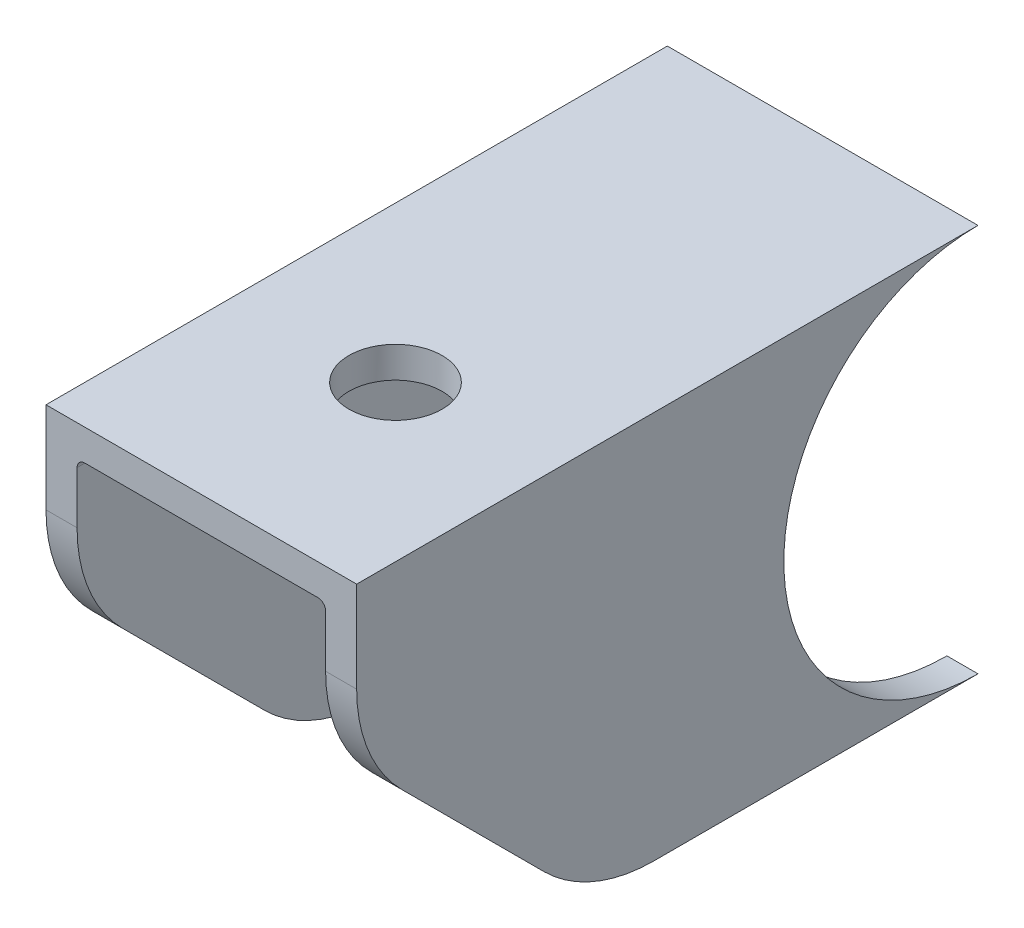
ISO-10303-21;
HEADER;
FILE_DESCRIPTION(('STEP AP214'),'2;1');
FILE_NAME('part.step','',(''),(''),'','','');
FILE_SCHEMA(('AUTOMOTIVE_DESIGN { 1 0 10303 214 1 1 1 1 }'));
ENDSEC;
DATA;
#1=APPLICATION_CONTEXT('core data for automotive mechanical design processes');
#2=APPLICATION_PROTOCOL_DEFINITION('international standard','automotive_design',2000,#1);
#3=PRODUCT_CONTEXT('',#1,'mechanical');
#4=PRODUCT('Part','Part','',(#3));
#5=PRODUCT_RELATED_PRODUCT_CATEGORY('part','',(#4));
#6=PRODUCT_DEFINITION_FORMATION('','',#4);
#7=PRODUCT_DEFINITION_CONTEXT('part definition',#1,'design');
#8=PRODUCT_DEFINITION('design','',#6,#7);
#9=PRODUCT_DEFINITION_SHAPE('','',#8);
#10=(LENGTH_UNIT() NAMED_UNIT(*) SI_UNIT(.MILLI.,.METRE.));
#11=(NAMED_UNIT(*) PLANE_ANGLE_UNIT() SI_UNIT($,.RADIAN.));
#12=(NAMED_UNIT(*) SI_UNIT($,.STERADIAN.) SOLID_ANGLE_UNIT());
#13=UNCERTAINTY_MEASURE_WITH_UNIT(LENGTH_MEASURE(1.E-05),#10,'distance_accuracy_value','');
#14=(GEOMETRIC_REPRESENTATION_CONTEXT(3) GLOBAL_UNCERTAINTY_ASSIGNED_CONTEXT((#13)) GLOBAL_UNIT_ASSIGNED_CONTEXT((#10,
#11,#12)) REPRESENTATION_CONTEXT('',''));
#15=CARTESIAN_POINT('',(0.,0.,0.));
#16=DIRECTION('',(0.,0.,1.));
#17=DIRECTION('',(1.,0.,0.));
#18=AXIS2_PLACEMENT_3D('',#15,#16,#17);
#19=CARTESIAN_POINT('',(10.,-12.5,0.));
#20=DIRECTION('',(-1.,0.,0.));
#21=DIRECTION('',(0.,0.,1.));
#22=AXIS2_PLACEMENT_3D('',#19,#20,#21);
#23=CYLINDRICAL_SURFACE('',#22,12.5);
#24=CARTESIAN_POINT('',(-8.,-12.5,0.));
#25=DIRECTION('',(1.,0.,0.));
#26=DIRECTION('',(0.,0.,-1.));
#27=AXIS2_PLACEMENT_3D('',#24,#25,#26);
#28=CIRCLE('',#27,12.5);
#29=CARTESIAN_POINT('',(-8.,-25.,0.));
#30=VERTEX_POINT('',#29);
#31=CARTESIAN_POINT('',(-8.,-2.5,7.5));
#32=VERTEX_POINT('',#31);
#33=EDGE_CURVE('E159',#30,#32,#28,.F.);
#34=ORIENTED_EDGE('',*,*,#33,.F.);
#35=DIRECTION('',(-1.,0.,0.));
#36=VECTOR('',#35,1.);
#37=CARTESIAN_POINT('',(10.,-25.,0.));
#38=LINE('',#37,#36);
#39=CARTESIAN_POINT('',(-10.,-25.,0.));
#40=VERTEX_POINT('',#39);
#41=EDGE_CURVE('E226',#30,#40,#38,.T.);
#42=ORIENTED_EDGE('',*,*,#41,.T.);
#43=CARTESIAN_POINT('',(-10.,-12.5,0.));
#44=DIRECTION('',(-1.,0.,0.));
#45=DIRECTION('',(0.,0.,-1.));
#46=AXIS2_PLACEMENT_3D('',#43,#44,#45);
#47=CIRCLE('',#46,12.5);
#48=CARTESIAN_POINT('',(-10.,0.,0.));
#49=VERTEX_POINT('',#48);
#50=EDGE_CURVE('E279',#40,#49,#47,.T.);
#51=ORIENTED_EDGE('',*,*,#50,.T.);
#52=DIRECTION('',(-1.,0.,0.));
#53=VECTOR('',#52,1.);
#54=CARTESIAN_POINT('',(10.,0.,0.));
#55=LINE('',#54,#53);
#56=CARTESIAN_POINT('',(10.,0.,0.));
#57=VERTEX_POINT('',#56);
#58=EDGE_CURVE('E185',#57,#49,#55,.T.);
#59=ORIENTED_EDGE('',*,*,#58,.F.);
#60=CARTESIAN_POINT('',(10.,-12.5,0.));
#61=DIRECTION('',(-1.,0.,0.));
#62=DIRECTION('',(0.,0.,-1.));
#63=AXIS2_PLACEMENT_3D('',#60,#61,#62);
#64=CIRCLE('',#63,12.5);
#65=CARTESIAN_POINT('',(10.,-25.,0.));
#66=VERTEX_POINT('',#65);
#67=EDGE_CURVE('E273',#66,#57,#64,.T.);
#68=ORIENTED_EDGE('',*,*,#67,.F.);
#69=CARTESIAN_POINT('',(8.,-25.,0.));
#70=VERTEX_POINT('',#69);
#71=EDGE_CURVE('E237',#66,#70,#38,.T.);
#72=ORIENTED_EDGE('',*,*,#71,.T.);
#73=CARTESIAN_POINT('',(8.,-12.5,0.));
#74=DIRECTION('',(1.,0.,0.));
#75=DIRECTION('',(0.,0.,-1.));
#76=AXIS2_PLACEMENT_3D('',#73,#74,#75);
#77=CIRCLE('',#76,12.5);
#78=CARTESIAN_POINT('',(8.,-2.5,7.5));
#79=VERTEX_POINT('',#78);
#80=EDGE_CURVE('E296',#70,#79,#77,.F.);
#81=ORIENTED_EDGE('',*,*,#80,.T.);
#82=CARTESIAN_POINT('',(8.,-2.5,7.5));
#83=CARTESIAN_POINT('',(7.99998111201067,-2.47657927949761,7.46877538585202));
#84=CARTESIAN_POINT('',(7.99835364855757,-2.45330701474388,7.43743808001431));
#85=CARTESIAN_POINT('',(7.99186438386388,-2.40716422156957,7.37469819847429));
#86=CARTESIAN_POINT('',(7.98699561690873,-2.38429466747719,7.3432956277175));
#87=CARTESIAN_POINT('',(7.97394686520214,-2.33895712103805,7.28043447608305));
#88=CARTESIAN_POINT('',(7.9657368681686,-2.31649474883029,7.24897803154152));
#89=CARTESIAN_POINT('',(7.94584993676061,-2.27239760210816,7.18662672012498));
#90=CARTESIAN_POINT('',(7.93417687811431,-2.25076193277354,7.15573126621438));
#91=CARTESIAN_POINT('',(7.90748815787542,-2.20923749763073,7.09587839911327));
#92=CARTESIAN_POINT('',(7.89259466857824,-2.189314711774,7.06689065624752));
#93=CARTESIAN_POINT('',(7.85879584701015,-2.15082750702616,7.01040583417564));
#94=CARTESIAN_POINT('',(7.83989705743709,-2.13226093845561,6.98290641464731));
#95=CARTESIAN_POINT('',(7.80197203317631,-2.10090136458833,6.93609130726328));
#96=CARTESIAN_POINT('',(7.78386201969749,-2.08772940473419,6.91629405809358));
#97=CARTESIAN_POINT('',(7.74427531689237,-2.06311162485265,6.87908814910643));
#98=CARTESIAN_POINT('',(7.72280490997478,-2.05166266041827,6.86167514349751));
#99=CARTESIAN_POINT('',(7.68466185762643,-2.03506963233934,6.83632749685912));
#100=CARTESIAN_POINT('',(7.66909271026389,-2.02914849169574,6.8272514048274));
#101=CARTESIAN_POINT('',(7.63652279209724,-2.01869649421798,6.81119426515334));
#102=CARTESIAN_POINT('',(7.61952774801879,-2.01416038625166,6.8042053067448));
#103=CARTESIAN_POINT('',(7.58576777938237,-2.00713815053857,6.79337112108118));
#104=CARTESIAN_POINT('',(7.56910299356689,-2.00451205152946,6.78931147139985));
#105=CARTESIAN_POINT('',(7.53498522925239,-2.00091977420155,6.78375402903197));
#106=CARTESIAN_POINT('',(7.51752531174428,-1.99997336951472,6.78228675510651));
#107=CARTESIAN_POINT('',(7.5,-2.,6.78232998312526));
#108=B_SPLINE_CURVE_WITH_KNOTS('',3,(#82,#83,#84,#85,#86,#87,#88,#89,#90,#91,#92,#93,#94,#95,
#96,#97,#98,#99,#100,#101,#102,#103,#104,#105,#106,#107),.UNSPECIFIED.,.F.,.F.,(4,2,2,2,2,2,2,2,
2,2,2,2,4),(0.,0.117065537632607,0.234383470279484,0.352779313941044,0.471043150104769,
0.585428606759346,0.699628634287558,0.78906590164108,0.878337916426487,0.935072597192397,
0.991589427199961,1.04336850489936,1.09575318944756),.UNSPECIFIED.);
#109=CARTESIAN_POINT('',(7.5,-2.,6.78232998312527));
#110=VERTEX_POINT('',#109);
#111=EDGE_CURVE('E198',#79,#110,#108,.T.);
#112=ORIENTED_EDGE('',*,*,#111,.T.);
#113=DIRECTION('',(-1.,0.,0.));
#114=VECTOR('',#113,1.);
#115=CARTESIAN_POINT('',(0.,-2.,6.78232998312527));
#116=LINE('',#115,#114);
#117=CARTESIAN_POINT('',(-7.5,-2.,6.78232998312527));
#118=VERTEX_POINT('',#117);
#119=EDGE_CURVE('E280',#110,#118,#116,.T.);
#120=ORIENTED_EDGE('',*,*,#119,.T.);
#121=CARTESIAN_POINT('',(-7.5,-2.,6.78232998312527));
#122=CARTESIAN_POINT('',(-7.51636069446058,-1.99997927322421,6.78229630082459));
#123=CARTESIAN_POINT('',(-7.53267151359374,-2.00080189844396,6.78357149333045));
#124=CARTESIAN_POINT('',(-7.56463197087793,-2.00394327158153,6.78843184344415));
#125=CARTESIAN_POINT('',(-7.58028667231974,-2.00624659854998,6.7919931910702));
#126=CARTESIAN_POINT('',(-7.61421389103335,-2.01284408590721,6.80217632310955));
#127=CARTESIAN_POINT('',(-7.63226380932752,-2.01747359049456,6.80931254140398));
#128=CARTESIAN_POINT('',(-7.66679180986435,-2.02829072245642,6.8259361464422));
#129=CARTESIAN_POINT('',(-7.68326287346725,-2.03448489906787,6.83543341309538));
#130=CARTESIAN_POINT('',(-7.72257374949386,-2.05152698831263,6.86146910360036));
#131=CARTESIAN_POINT('',(-7.74434109459155,-2.06313134971403,6.87911898005314));
#132=CARTESIAN_POINT('',(-7.78442986275067,-2.08810409161831,6.91685928907109));
#133=CARTESIAN_POINT('',(-7.80274441555157,-2.10147590089815,6.93695445923328));
#134=CARTESIAN_POINT('',(-7.84837915451177,-2.13938978387627,6.99353900849065));
#135=CARTESIAN_POINT('',(-7.87284356322888,-2.16511400482246,7.03152585956123));
#136=CARTESIAN_POINT('',(-7.91482611026253,-2.2187882210858,7.10977933984325));
#137=CARTESIAN_POINT('',(-7.93231685690656,-2.2467464855408,7.15005426270504));
#138=CARTESIAN_POINT('',(-7.95575354473822,-2.29338544410539,7.21636994102709));
#139=CARTESIAN_POINT('',(-7.96356938969212,-2.31161536687121,7.2420872672798));
#140=CARTESIAN_POINT('',(-7.97691880507878,-2.34855827154117,7.29378090701257));
#141=CARTESIAN_POINT('',(-7.9824516323616,-2.36727140863454,7.31975730200908));
#142=CARTESIAN_POINT('',(-7.99123519313859,-2.40483823170314,7.37147994296939));
#143=CARTESIAN_POINT('',(-7.99451393156063,-2.42368713895617,7.39722493915827));
#144=CARTESIAN_POINT('',(-7.99889137969416,-2.46165732780112,7.44867122012757));
#145=CARTESIAN_POINT('',(-7.99999162639332,-2.48077840776753,7.4743725229344));
#146=CARTESIAN_POINT('',(-8.,-2.5,7.5));
#147=B_SPLINE_CURVE_WITH_KNOTS('',3,(#121,#122,#123,#124,#125,#126,#127,#128,#129,#130,#131,
#132,#133,#134,#135,#136,#137,#138,#139,#140,#141,#142,#143,#144,#145,#146),.UNSPECIFIED.,.F.,
.F.,(4,2,2,2,2,2,2,2,2,2,2,2,4),(0.,0.0489310685291968,0.0973606173879574,0.156892551283479,
0.216677920632218,0.307161335343699,0.39782293364766,0.552947012698774,0.708674534911484,
0.806027831033501,0.903412791881953,0.999564841043815,1.09564902800259),.UNSPECIFIED.);
#148=EDGE_CURVE('E11',#118,#32,#147,.T.);
#149=ORIENTED_EDGE('',*,*,#148,.T.);
#150=EDGE_LOOP('',(#34,#42,#51,#59,#68,#72,#81,#112,#120,#149));
#151=FACE_BOUND('',#150,.T.);
#152=ADVANCED_FACE('F37',(#151),#23,.F.);
#153=CARTESIAN_POINT('',(10.,0.,40.));
#154=DIRECTION('',(0.,0.,-1.));
#155=DIRECTION('',(0.,1.,0.));
#156=AXIS2_PLACEMENT_3D('',#153,#154,#155);
#157=PLANE('',#156);
#158=DIRECTION('',(0.,-1.,0.));
#159=VECTOR('',#158,1.);
#160=CARTESIAN_POINT('',(-8.,0.,40.));
#161=LINE('',#160,#159);
#162=CARTESIAN_POINT('',(-8.,-2.5,40.));
#163=VERTEX_POINT('',#162);
#164=CARTESIAN_POINT('',(-8.,-5.8578643762692,40.));
#165=VERTEX_POINT('',#164);
#166=EDGE_CURVE('E151',#163,#165,#161,.T.);
#167=ORIENTED_EDGE('',*,*,#166,.F.);
#168=CARTESIAN_POINT('',(-7.5,-2.5,40.));
#169=DIRECTION('',(0.,0.,-1.));
#170=DIRECTION('',(0.,1.,0.));
#171=AXIS2_PLACEMENT_3D('',#168,#169,#170);
#172=CIRCLE('',#171,0.5);
#173=CARTESIAN_POINT('',(-7.5,-2.,40.));
#174=VERTEX_POINT('',#173);
#175=EDGE_CURVE('E47',#163,#174,#172,.T.);
#176=ORIENTED_EDGE('',*,*,#175,.T.);
#177=DIRECTION('',(-1.,0.,0.));
#178=VECTOR('',#177,1.);
#179=CARTESIAN_POINT('',(10.,-2.,40.));
#180=LINE('',#179,#178);
#181=CARTESIAN_POINT('',(7.5,-2.,40.));
#182=VERTEX_POINT('',#181);
#183=EDGE_CURVE('E307',#182,#174,#180,.T.);
#184=ORIENTED_EDGE('',*,*,#183,.F.);
#185=CARTESIAN_POINT('',(7.5,-2.5,40.));
#186=DIRECTION('',(0.,0.,-1.));
#187=DIRECTION('',(0.,1.,0.));
#188=AXIS2_PLACEMENT_3D('',#185,#186,#187);
#189=CIRCLE('',#188,0.5);
#190=CARTESIAN_POINT('',(8.,-2.5,40.));
#191=VERTEX_POINT('',#190);
#192=EDGE_CURVE('E196',#182,#191,#189,.T.);
#193=ORIENTED_EDGE('',*,*,#192,.T.);
#194=DIRECTION('',(0.,-1.,0.));
#195=VECTOR('',#194,1.);
#196=CARTESIAN_POINT('',(8.,0.,40.));
#197=LINE('',#196,#195);
#198=CARTESIAN_POINT('',(8.,-5.8578643762692,40.));
#199=VERTEX_POINT('',#198);
#200=EDGE_CURVE('E293',#191,#199,#197,.T.);
#201=ORIENTED_EDGE('',*,*,#200,.T.);
#202=DIRECTION('',(-1.,0.,0.));
#203=VECTOR('',#202,1.);
#204=CARTESIAN_POINT('',(10.,-5.8578643762692,40.));
#205=LINE('',#204,#203);
#206=CARTESIAN_POINT('',(10.,-5.8578643762692,40.));
#207=VERTEX_POINT('',#206);
#208=EDGE_CURVE('E175',#207,#199,#205,.T.);
#209=ORIENTED_EDGE('',*,*,#208,.F.);
#210=DIRECTION('',(0.,-1.,0.));
#211=VECTOR('',#210,1.);
#212=CARTESIAN_POINT('',(10.,0.,40.));
#213=LINE('',#212,#211);
#214=CARTESIAN_POINT('',(10.,0.,40.));
#215=VERTEX_POINT('',#214);
#216=EDGE_CURVE('E287',#215,#207,#213,.T.);
#217=ORIENTED_EDGE('',*,*,#216,.F.);
#218=DIRECTION('',(-1.,0.,0.));
#219=VECTOR('',#218,1.);
#220=CARTESIAN_POINT('',(10.,0.,40.));
#221=LINE('',#220,#219);
#222=CARTESIAN_POINT('',(-10.,0.,40.));
#223=VERTEX_POINT('',#222);
#224=EDGE_CURVE('E179',#215,#223,#221,.T.);
#225=ORIENTED_EDGE('',*,*,#224,.T.);
#226=DIRECTION('',(0.,-1.,0.));
#227=VECTOR('',#226,1.);
#228=CARTESIAN_POINT('',(-10.,0.,40.));
#229=LINE('',#228,#227);
#230=CARTESIAN_POINT('',(-10.,-5.8578643762692,40.));
#231=VERTEX_POINT('',#230);
#232=EDGE_CURVE('E173',#223,#231,#229,.T.);
#233=ORIENTED_EDGE('',*,*,#232,.T.);
#234=EDGE_CURVE('E165',#165,#231,#205,.T.);
#235=ORIENTED_EDGE('',*,*,#234,.F.);
#236=EDGE_LOOP('',(#167,#176,#184,#193,#201,#209,#217,#225,#233,#235));
#237=FACE_BOUND('',#236,.T.);
#238=ADVANCED_FACE('F170',(#237),#157,.F.);
#239=CARTESIAN_POINT('',(10.,-5.8578643762692,30.));
#240=DIRECTION('',(-1.,0.,0.));
#241=DIRECTION('',(0.,0.,1.));
#242=AXIS2_PLACEMENT_3D('',#239,#240,#241);
#243=CYLINDRICAL_SURFACE('',#242,10.);
#244=CARTESIAN_POINT('',(-8.,-5.8578643762692,30.));
#245=DIRECTION('',(1.,0.,0.));
#246=DIRECTION('',(0.,0.,-1.));
#247=AXIS2_PLACEMENT_3D('',#244,#245,#246);
#248=CIRCLE('',#247,10.);
#249=CARTESIAN_POINT('',(-8.,-12.9289321881347,37.0710678118654));
#250=VERTEX_POINT('',#249);
#251=EDGE_CURVE('E154',#165,#250,#248,.T.);
#252=ORIENTED_EDGE('',*,*,#251,.F.);
#253=ORIENTED_EDGE('',*,*,#234,.T.);
#254=CARTESIAN_POINT('',(-10.,-5.8578643762692,30.));
#255=DIRECTION('',(1.,0.,0.));
#256=DIRECTION('',(0.,0.,1.));
#257=AXIS2_PLACEMENT_3D('',#254,#255,#256);
#258=CIRCLE('',#257,10.);
#259=CARTESIAN_POINT('',(-10.,-12.9289321881347,37.0710678118654));
#260=VERTEX_POINT('',#259);
#261=EDGE_CURVE('E270',#231,#260,#258,.T.);
#262=ORIENTED_EDGE('',*,*,#261,.T.);
#263=DIRECTION('',(-1.,0.,0.));
#264=VECTOR('',#263,1.);
#265=CARTESIAN_POINT('',(10.,-12.9289321881347,37.0710678118654));
#266=LINE('',#265,#264);
#267=EDGE_CURVE('E167',#250,#260,#266,.T.);
#268=ORIENTED_EDGE('',*,*,#267,.F.);
#269=EDGE_LOOP('',(#252,#253,#262,#268));
#270=FACE_BOUND('',#269,.T.);
#271=ADVANCED_FACE('F163',(#270),#243,.T.);
#272=CARTESIAN_POINT('',(10.,-12.9289321881347,37.0710678118654));
#273=DIRECTION('',(0.,0.707106781186551,-0.707106781186544));
#274=DIRECTION('',(0.,0.707106781186544,0.707106781186551));
#275=AXIS2_PLACEMENT_3D('',#272,#273,#274);
#276=PLANE('',#275);
#277=DIRECTION('',(0.,-0.707106781186544,-0.707106781186551));
#278=VECTOR('',#277,1.);
#279=CARTESIAN_POINT('',(-8.,-12.9289321881347,37.0710678118654));
#280=LINE('',#279,#278);
#281=CARTESIAN_POINT('',(-8.,-22.0710678118655,27.9289321881345));
#282=VERTEX_POINT('',#281);
#283=EDGE_CURVE('E168',#250,#282,#280,.T.);
#284=ORIENTED_EDGE('',*,*,#283,.F.);
#285=ORIENTED_EDGE('',*,*,#267,.T.);
#286=DIRECTION('',(0.,-0.707106781186544,-0.707106781186551));
#287=VECTOR('',#286,1.);
#288=CARTESIAN_POINT('',(-10.,-12.9289321881347,37.0710678118654));
#289=LINE('',#288,#287);
#290=CARTESIAN_POINT('',(-10.,-22.0710678118655,27.9289321881345));
#291=VERTEX_POINT('',#290);
#292=EDGE_CURVE('E267',#260,#291,#289,.T.);
#293=ORIENTED_EDGE('',*,*,#292,.T.);
#294=DIRECTION('',(-1.,0.,0.));
#295=VECTOR('',#294,1.);
#296=CARTESIAN_POINT('',(10.,-22.0710678118655,27.9289321881345));
#297=LINE('',#296,#295);
#298=EDGE_CURVE('E249',#282,#291,#297,.T.);
#299=ORIENTED_EDGE('',*,*,#298,.F.);
#300=EDGE_LOOP('',(#284,#285,#293,#299));
#301=FACE_BOUND('',#300,.T.);
#302=ADVANCED_FACE('F268',(#301),#276,.F.);
#303=CARTESIAN_POINT('',(10.,-15.,20.8578643762691));
#304=DIRECTION('',(-1.,0.,0.));
#305=DIRECTION('',(0.,0.,1.));
#306=AXIS2_PLACEMENT_3D('',#303,#304,#305);
#307=CYLINDRICAL_SURFACE('',#306,10.);
#308=CARTESIAN_POINT('',(-8.,-15.,20.8578643762691));
#309=DIRECTION('',(1.,0.,0.));
#310=DIRECTION('',(0.,0.,-1.));
#311=AXIS2_PLACEMENT_3D('',#308,#309,#310);
#312=CIRCLE('',#311,10.);
#313=CARTESIAN_POINT('',(-8.,-25.,20.8578643762691));
#314=VERTEX_POINT('',#313);
#315=EDGE_CURVE('E264',#282,#314,#312,.T.);
#316=ORIENTED_EDGE('',*,*,#315,.F.);
#317=ORIENTED_EDGE('',*,*,#298,.T.);
#318=CARTESIAN_POINT('',(-10.,-15.,20.8578643762691));
#319=DIRECTION('',(1.,0.,0.));
#320=DIRECTION('',(0.,0.,1.));
#321=AXIS2_PLACEMENT_3D('',#318,#319,#320);
#322=CIRCLE('',#321,10.);
#323=CARTESIAN_POINT('',(-10.,-25.,20.8578643762691));
#324=VERTEX_POINT('',#323);
#325=EDGE_CURVE('E263',#291,#324,#322,.T.);
#326=ORIENTED_EDGE('',*,*,#325,.T.);
#327=DIRECTION('',(-1.,0.,0.));
#328=VECTOR('',#327,1.);
#329=CARTESIAN_POINT('',(10.,-25.,20.8578643762691));
#330=LINE('',#329,#328);
#331=EDGE_CURVE('E241',#314,#324,#330,.T.);
#332=ORIENTED_EDGE('',*,*,#331,.F.);
#333=EDGE_LOOP('',(#316,#317,#326,#332));
#334=FACE_BOUND('',#333,.T.);
#335=ADVANCED_FACE('F261',(#334),#307,.T.);
#336=CARTESIAN_POINT('',(10.,-25.,0.));
#337=DIRECTION('',(0.,1.,0.));
#338=DIRECTION('',(0.,0.,1.));
#339=AXIS2_PLACEMENT_3D('',#336,#337,#338);
#340=PLANE('',#339);
#341=DIRECTION('',(0.,0.,-1.));
#342=VECTOR('',#341,1.);
#343=CARTESIAN_POINT('',(-8.,-25.,0.));
#344=LINE('',#343,#342);
#345=EDGE_CURVE('E232',#314,#30,#344,.T.);
#346=ORIENTED_EDGE('',*,*,#345,.F.);
#347=ORIENTED_EDGE('',*,*,#331,.T.);
#348=DIRECTION('',(0.,0.,-1.));
#349=VECTOR('',#348,1.);
#350=CARTESIAN_POINT('',(-10.,-25.,0.));
#351=LINE('',#350,#349);
#352=EDGE_CURVE('E235',#324,#40,#351,.T.);
#353=ORIENTED_EDGE('',*,*,#352,.T.);
#354=ORIENTED_EDGE('',*,*,#41,.F.);
#355=EDGE_LOOP('',(#346,#347,#353,#354));
#356=FACE_BOUND('',#355,.T.);
#357=ADVANCED_FACE('F231',(#356),#340,.F.);
#358=CARTESIAN_POINT('',(10.,0.,40.));
#359=DIRECTION('',(0.,-1.,0.));
#360=DIRECTION('',(0.,0.,-1.));
#361=AXIS2_PLACEMENT_3D('',#358,#359,#360);
#362=PLANE('',#361);
#363=CARTESIAN_POINT('',(0.,0.,27.5));
#364=DIRECTION('',(0.,1.,0.));
#365=DIRECTION('',(0.,0.,1.));
#366=AXIS2_PLACEMENT_3D('',#363,#364,#365);
#367=CIRCLE('',#366,3.);
#368=CARTESIAN_POINT('',(0.,0.,30.5));
#369=VERTEX_POINT('',#368);
#370=EDGE_CURVE('E316',#369,#369,#367,.T.);
#371=ORIENTED_EDGE('',*,*,#370,.F.);
#372=EDGE_LOOP('',(#371));
#373=FACE_BOUND('',#372,.T.);
#374=DIRECTION('',(0.,0.,1.));
#375=VECTOR('',#374,1.);
#376=CARTESIAN_POINT('',(-10.,0.,40.));
#377=LINE('',#376,#375);
#378=EDGE_CURVE('E277',#49,#223,#377,.T.);
#379=ORIENTED_EDGE('',*,*,#378,.T.);
#380=ORIENTED_EDGE('',*,*,#224,.F.);
#381=DIRECTION('',(0.,0.,1.));
#382=VECTOR('',#381,1.);
#383=CARTESIAN_POINT('',(10.,0.,40.));
#384=LINE('',#383,#382);
#385=EDGE_CURVE('E289',#57,#215,#384,.T.);
#386=ORIENTED_EDGE('',*,*,#385,.F.);
#387=ORIENTED_EDGE('',*,*,#58,.T.);
#388=EDGE_LOOP('',(#379,#380,#386,#387));
#389=FACE_BOUND('',#388,.T.);
#390=ADVANCED_FACE('F347',(#373,#389),#362,.F.);
#391=ORIENTED_EDGE('',*,*,#208,.T.);
#392=CARTESIAN_POINT('',(8.,-5.8578643762692,30.));
#393=DIRECTION('',(1.,0.,0.));
#394=DIRECTION('',(0.,0.,-1.));
#395=AXIS2_PLACEMENT_3D('',#392,#393,#394);
#396=CIRCLE('',#395,10.);
#397=CARTESIAN_POINT('',(8.,-12.9289321881347,37.0710678118654));
#398=VERTEX_POINT('',#397);
#399=EDGE_CURVE('E295',#199,#398,#396,.T.);
#400=ORIENTED_EDGE('',*,*,#399,.T.);
#401=CARTESIAN_POINT('',(10.,-12.9289321881347,37.0710678118654));
#402=VERTEX_POINT('',#401);
#403=EDGE_CURVE('E176',#402,#398,#266,.T.);
#404=ORIENTED_EDGE('',*,*,#403,.F.);
#405=CARTESIAN_POINT('',(10.,-5.8578643762692,30.));
#406=DIRECTION('',(1.,0.,0.));
#407=DIRECTION('',(0.,0.,1.));
#408=AXIS2_PLACEMENT_3D('',#405,#406,#407);
#409=CIRCLE('',#408,10.);
#410=EDGE_CURVE('E285',#207,#402,#409,.T.);
#411=ORIENTED_EDGE('',*,*,#410,.F.);
#412=EDGE_LOOP('',(#391,#400,#404,#411));
#413=FACE_BOUND('',#412,.T.);
#414=ADVANCED_FACE('F339',(#413),#243,.T.);
#415=ORIENTED_EDGE('',*,*,#403,.T.);
#416=DIRECTION('',(0.,-0.707106781186544,-0.707106781186551));
#417=VECTOR('',#416,1.);
#418=CARTESIAN_POINT('',(8.,-12.9289321881347,37.0710678118654));
#419=LINE('',#418,#417);
#420=CARTESIAN_POINT('',(8.,-22.0710678118655,27.9289321881345));
#421=VERTEX_POINT('',#420);
#422=EDGE_CURVE('E299',#398,#421,#419,.T.);
#423=ORIENTED_EDGE('',*,*,#422,.T.);
#424=CARTESIAN_POINT('',(10.,-22.0710678118655,27.9289321881345));
#425=VERTEX_POINT('',#424);
#426=EDGE_CURVE('E250',#425,#421,#297,.T.);
#427=ORIENTED_EDGE('',*,*,#426,.F.);
#428=DIRECTION('',(0.,-0.707106781186544,-0.707106781186551));
#429=VECTOR('',#428,1.);
#430=CARTESIAN_POINT('',(10.,-12.9289321881347,37.0710678118654));
#431=LINE('',#430,#429);
#432=EDGE_CURVE('E283',#402,#425,#431,.T.);
#433=ORIENTED_EDGE('',*,*,#432,.F.);
#434=EDGE_LOOP('',(#415,#423,#427,#433));
#435=FACE_BOUND('',#434,.T.);
#436=ADVANCED_FACE('F356',(#435),#276,.F.);
#437=ORIENTED_EDGE('',*,*,#426,.T.);
#438=CARTESIAN_POINT('',(8.,-15.,20.8578643762691));
#439=DIRECTION('',(1.,0.,0.));
#440=DIRECTION('',(0.,0.,-1.));
#441=AXIS2_PLACEMENT_3D('',#438,#439,#440);
#442=CIRCLE('',#441,10.);
#443=CARTESIAN_POINT('',(8.,-25.,20.8578643762691));
#444=VERTEX_POINT('',#443);
#445=EDGE_CURVE('E302',#421,#444,#442,.T.);
#446=ORIENTED_EDGE('',*,*,#445,.T.);
#447=CARTESIAN_POINT('',(10.,-25.,20.8578643762691));
#448=VERTEX_POINT('',#447);
#449=EDGE_CURVE('E247',#448,#444,#330,.T.);
#450=ORIENTED_EDGE('',*,*,#449,.F.);
#451=CARTESIAN_POINT('',(10.,-15.,20.8578643762691));
#452=DIRECTION('',(1.,0.,0.));
#453=DIRECTION('',(0.,0.,1.));
#454=AXIS2_PLACEMENT_3D('',#451,#452,#453);
#455=CIRCLE('',#454,10.);
#456=EDGE_CURVE('E242',#425,#448,#455,.T.);
#457=ORIENTED_EDGE('',*,*,#456,.F.);
#458=EDGE_LOOP('',(#437,#446,#450,#457));
#459=FACE_BOUND('',#458,.T.);
#460=ADVANCED_FACE('F353',(#459),#307,.T.);
#461=ORIENTED_EDGE('',*,*,#449,.T.);
#462=DIRECTION('',(0.,0.,-1.));
#463=VECTOR('',#462,1.);
#464=CARTESIAN_POINT('',(8.,-25.,0.));
#465=LINE('',#464,#463);
#466=EDGE_CURVE('E304',#444,#70,#465,.T.);
#467=ORIENTED_EDGE('',*,*,#466,.T.);
#468=ORIENTED_EDGE('',*,*,#71,.F.);
#469=DIRECTION('',(0.,0.,-1.));
#470=VECTOR('',#469,1.);
#471=CARTESIAN_POINT('',(10.,-25.,0.));
#472=LINE('',#471,#470);
#473=EDGE_CURVE('E238',#448,#66,#472,.T.);
#474=ORIENTED_EDGE('',*,*,#473,.F.);
#475=EDGE_LOOP('',(#461,#467,#468,#474));
#476=FACE_BOUND('',#475,.T.);
#477=ADVANCED_FACE('F351',(#476),#340,.F.);
#478=CARTESIAN_POINT('',(10.,-12.5,0.));
#479=DIRECTION('',(1.,0.,0.));
#480=DIRECTION('',(0.,0.,-1.));
#481=AXIS2_PLACEMENT_3D('',#478,#479,#480);
#482=PLANE('',#481);
#483=ORIENTED_EDGE('',*,*,#67,.T.);
#484=ORIENTED_EDGE('',*,*,#385,.T.);
#485=ORIENTED_EDGE('',*,*,#216,.T.);
#486=ORIENTED_EDGE('',*,*,#410,.T.);
#487=ORIENTED_EDGE('',*,*,#432,.T.);
#488=ORIENTED_EDGE('',*,*,#456,.T.);
#489=ORIENTED_EDGE('',*,*,#473,.T.);
#490=EDGE_LOOP('',(#483,#484,#485,#486,#487,#488,#489));
#491=FACE_BOUND('',#490,.T.);
#492=ADVANCED_FACE('F343',(#491),#482,.T.);
#493=CARTESIAN_POINT('',(-10.,-12.5,0.));
#494=DIRECTION('',(1.,0.,0.));
#495=DIRECTION('',(0.,0.,-1.));
#496=AXIS2_PLACEMENT_3D('',#493,#494,#495);
#497=PLANE('',#496);
#498=ORIENTED_EDGE('',*,*,#50,.F.);
#499=ORIENTED_EDGE('',*,*,#352,.F.);
#500=ORIENTED_EDGE('',*,*,#325,.F.);
#501=ORIENTED_EDGE('',*,*,#292,.F.);
#502=ORIENTED_EDGE('',*,*,#261,.F.);
#503=ORIENTED_EDGE('',*,*,#232,.F.);
#504=ORIENTED_EDGE('',*,*,#378,.F.);
#505=EDGE_LOOP('',(#498,#499,#500,#501,#502,#503,#504));
#506=FACE_BOUND('',#505,.T.);
#507=ADVANCED_FACE('F272',(#506),#497,.F.);
#508=CARTESIAN_POINT('',(10.,-2.,40.));
#509=DIRECTION('',(0.,-1.,0.));
#510=DIRECTION('',(0.,0.,-1.));
#511=AXIS2_PLACEMENT_3D('',#508,#509,#510);
#512=PLANE('',#511);
#513=CARTESIAN_POINT('',(0.,-2.,27.5));
#514=DIRECTION('',(0.,-1.,0.));
#515=DIRECTION('',(0.,0.,-1.));
#516=AXIS2_PLACEMENT_3D('',#513,#514,#515);
#517=CIRCLE('',#516,3.);
#518=CARTESIAN_POINT('',(0.,-2.,24.5));
#519=VERTEX_POINT('',#518);
#520=EDGE_CURVE('E42',#519,#519,#517,.T.);
#521=ORIENTED_EDGE('',*,*,#520,.F.);
#522=EDGE_LOOP('',(#521));
#523=FACE_BOUND('',#522,.T.);
#524=ORIENTED_EDGE('',*,*,#119,.F.);
#525=DIRECTION('',(0.,0.,1.));
#526=VECTOR('',#525,1.);
#527=CARTESIAN_POINT('',(7.5,-2.,40.));
#528=LINE('',#527,#526);
#529=EDGE_CURVE('E190',#110,#182,#528,.T.);
#530=ORIENTED_EDGE('',*,*,#529,.T.);
#531=ORIENTED_EDGE('',*,*,#183,.T.);
#532=DIRECTION('',(0.,0.,1.));
#533=VECTOR('',#532,1.);
#534=CARTESIAN_POINT('',(-7.5,-2.,6.78232998312527));
#535=LINE('',#534,#533);
#536=EDGE_CURVE('E188',#174,#118,#535,.F.);
#537=ORIENTED_EDGE('',*,*,#536,.T.);
#538=EDGE_LOOP('',(#524,#530,#531,#537));
#539=FACE_BOUND('',#538,.T.);
#540=ADVANCED_FACE('F324',(#523,#539),#512,.T.);
#541=CARTESIAN_POINT('',(8.,-12.5,0.));
#542=DIRECTION('',(1.,0.,0.));
#543=DIRECTION('',(0.,0.,-1.));
#544=AXIS2_PLACEMENT_3D('',#541,#542,#543);
#545=PLANE('',#544);
#546=ORIENTED_EDGE('',*,*,#200,.F.);
#547=DIRECTION('',(0.,0.,1.));
#548=VECTOR('',#547,1.);
#549=CARTESIAN_POINT('',(8.,-2.5,0.));
#550=LINE('',#549,#548);
#551=EDGE_CURVE('E193',#191,#79,#550,.F.);
#552=ORIENTED_EDGE('',*,*,#551,.T.);
#553=ORIENTED_EDGE('',*,*,#80,.F.);
#554=ORIENTED_EDGE('',*,*,#466,.F.);
#555=ORIENTED_EDGE('',*,*,#445,.F.);
#556=ORIENTED_EDGE('',*,*,#422,.F.);
#557=ORIENTED_EDGE('',*,*,#399,.F.);
#558=EDGE_LOOP('',(#546,#552,#553,#554,#555,#556,#557));
#559=FACE_BOUND('',#558,.T.);
#560=ADVANCED_FACE('F216',(#559),#545,.F.);
#561=CARTESIAN_POINT('',(-8.,-12.5,0.));
#562=DIRECTION('',(1.,0.,0.));
#563=DIRECTION('',(0.,0.,-1.));
#564=AXIS2_PLACEMENT_3D('',#561,#562,#563);
#565=PLANE('',#564);
#566=ORIENTED_EDGE('',*,*,#33,.T.);
#567=DIRECTION('',(0.,0.,1.));
#568=VECTOR('',#567,1.);
#569=CARTESIAN_POINT('',(-8.,-2.5,40.));
#570=LINE('',#569,#568);
#571=EDGE_CURVE('E156',#32,#163,#570,.T.);
#572=ORIENTED_EDGE('',*,*,#571,.T.);
#573=ORIENTED_EDGE('',*,*,#166,.T.);
#574=ORIENTED_EDGE('',*,*,#251,.T.);
#575=ORIENTED_EDGE('',*,*,#283,.T.);
#576=ORIENTED_EDGE('',*,*,#315,.T.);
#577=ORIENTED_EDGE('',*,*,#345,.T.);
#578=EDGE_LOOP('',(#566,#572,#573,#574,#575,#576,#577));
#579=FACE_BOUND('',#578,.T.);
#580=ADVANCED_FACE('F153',(#579),#565,.T.);
#581=CARTESIAN_POINT('',(7.5,-2.5,40.));
#582=DIRECTION('',(0.,0.,1.));
#583=DIRECTION('',(1.,0.,0.));
#584=AXIS2_PLACEMENT_3D('',#581,#582,#583);
#585=CYLINDRICAL_SURFACE('',#584,0.5);
#586=ORIENTED_EDGE('',*,*,#111,.F.);
#587=ORIENTED_EDGE('',*,*,#551,.F.);
#588=ORIENTED_EDGE('',*,*,#192,.F.);
#589=ORIENTED_EDGE('',*,*,#529,.F.);
#590=EDGE_LOOP('',(#586,#587,#588,#589));
#591=FACE_BOUND('',#590,.T.);
#592=ADVANCED_FACE('F207',(#591),#585,.F.);
#593=CARTESIAN_POINT('',(-7.5,-2.5,0.));
#594=DIRECTION('',(0.,0.,-1.));
#595=DIRECTION('',(-1.,0.,0.));
#596=AXIS2_PLACEMENT_3D('',#593,#594,#595);
#597=CYLINDRICAL_SURFACE('',#596,0.5);
#598=ORIENTED_EDGE('',*,*,#148,.F.);
#599=ORIENTED_EDGE('',*,*,#536,.F.);
#600=ORIENTED_EDGE('',*,*,#175,.F.);
#601=ORIENTED_EDGE('',*,*,#571,.F.);
#602=EDGE_LOOP('',(#598,#599,#600,#601));
#603=FACE_BOUND('',#602,.T.);
#604=ADVANCED_FACE('F39',(#603),#597,.F.);
#605=CARTESIAN_POINT('',(0.,-10.,27.5));
#606=DIRECTION('',(0.,1.,0.));
#607=DIRECTION('',(0.,0.,1.));
#608=AXIS2_PLACEMENT_3D('',#605,#606,#607);
#609=CYLINDRICAL_SURFACE('',#608,3.);
#610=ORIENTED_EDGE('',*,*,#520,.T.);
#611=EDGE_LOOP('',(#610));
#612=FACE_BOUND('',#611,.T.);
#613=ORIENTED_EDGE('',*,*,#370,.T.);
#614=EDGE_LOOP('',(#613));
#615=FACE_BOUND('',#614,.T.);
#616=ADVANCED_FACE('F215',(#612,#615),#609,.F.);
#617=CLOSED_SHELL('',(#152,#238,#271,#302,#335,#357,#390,#414,#436,#460,#477,#492,#507,#540,
#560,#580,#592,#604,#616));
#618=MANIFOLD_SOLID_BREP('B2',#617);
#619=ADVANCED_BREP_SHAPE_REPRESENTATION('',(#18,#618),#14);
#620=SHAPE_DEFINITION_REPRESENTATION(#9,#619);
ENDSEC;
END-ISO-10303-21;
